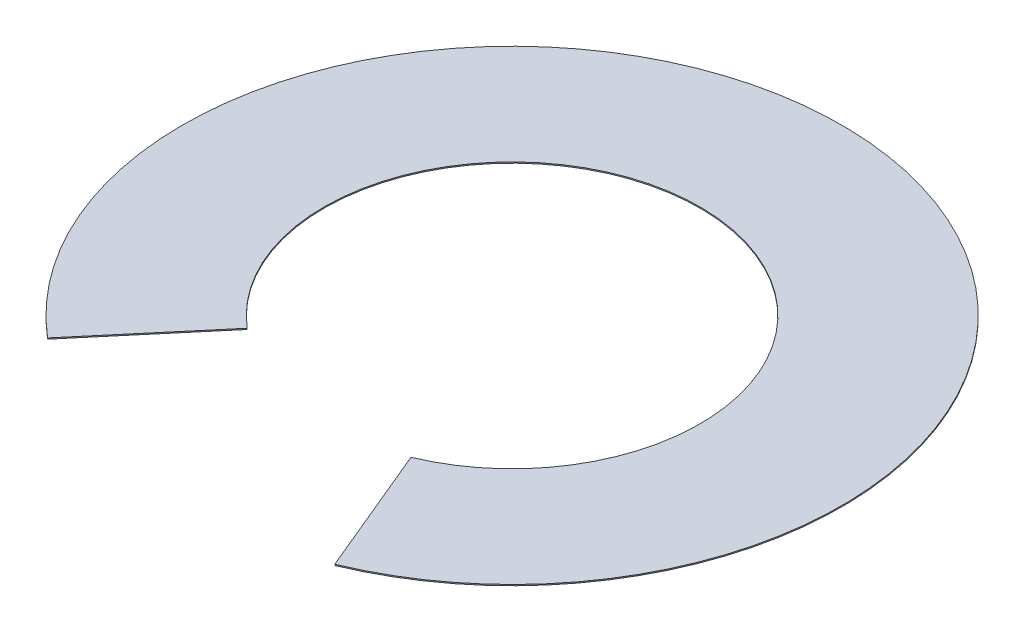
ISO-10303-21;
HEADER;
FILE_DESCRIPTION(('STEP AP214'),'2;1');
FILE_NAME('part.step','',(''),(''),'','','');
FILE_SCHEMA(('AUTOMOTIVE_DESIGN { 1 0 10303 214 1 1 1 1 }'));
ENDSEC;
DATA;
#1=APPLICATION_CONTEXT('core data for automotive mechanical design processes');
#2=APPLICATION_PROTOCOL_DEFINITION('international standard','automotive_design',2000,#1);
#3=PRODUCT_CONTEXT('',#1,'mechanical');
#4=PRODUCT('Part','Part','',(#3));
#5=PRODUCT_RELATED_PRODUCT_CATEGORY('part','',(#4));
#6=PRODUCT_DEFINITION_FORMATION('','',#4);
#7=PRODUCT_DEFINITION_CONTEXT('part definition',#1,'design');
#8=PRODUCT_DEFINITION('design','',#6,#7);
#9=PRODUCT_DEFINITION_SHAPE('','',#8);
#10=(LENGTH_UNIT() NAMED_UNIT(*) SI_UNIT(.MILLI.,.METRE.));
#11=(NAMED_UNIT(*) PLANE_ANGLE_UNIT() SI_UNIT($,.RADIAN.));
#12=(NAMED_UNIT(*) SI_UNIT($,.STERADIAN.) SOLID_ANGLE_UNIT());
#13=UNCERTAINTY_MEASURE_WITH_UNIT(LENGTH_MEASURE(1.E-05),#10,'distance_accuracy_value','');
#14=(GEOMETRIC_REPRESENTATION_CONTEXT(3) GLOBAL_UNCERTAINTY_ASSIGNED_CONTEXT((#13)) GLOBAL_UNIT_ASSIGNED_CONTEXT((#10,
#11,#12)) REPRESENTATION_CONTEXT('',''));
#15=CARTESIAN_POINT('',(0.,0.,0.));
#16=DIRECTION('',(0.,0.,1.));
#17=DIRECTION('',(1.,0.,0.));
#18=AXIS2_PLACEMENT_3D('',#15,#16,#17);
#19=CARTESIAN_POINT('',(0.,1.6,0.));
#20=DIRECTION('',(0.,-1.,0.));
#21=DIRECTION('',(0.,0.,-1.));
#22=AXIS2_PLACEMENT_3D('',#19,#20,#21);
#23=CYLINDRICAL_SURFACE('',#22,268.);
#24=CARTESIAN_POINT('',(0.,0.,0.));
#25=DIRECTION('',(0.,-1.,0.));
#26=DIRECTION('',(0.,0.,1.));
#27=AXIS2_PLACEMENT_3D('',#24,#25,#26);
#28=CIRCLE('',#27,268.);
#29=CARTESIAN_POINT('',(-172.957520303554,0.,204.718577980714));
#30=VERTEX_POINT('',#29);
#31=CARTESIAN_POINT('',(103.176288503488,0.,247.343189699342));
#32=VERTEX_POINT('',#31);
#33=EDGE_CURVE('E94',#30,#32,#28,.T.);
#34=ORIENTED_EDGE('',*,*,#33,.T.);
#35=DIRECTION('',(0.,-1.,0.));
#36=VECTOR('',#35,1.);
#37=CARTESIAN_POINT('',(103.176288503488,1.6,247.343189699342));
#38=LINE('',#37,#36);
#39=CARTESIAN_POINT('',(103.176288503488,1.6,247.343189699342));
#40=VERTEX_POINT('',#39);
#41=EDGE_CURVE('E11',#40,#32,#38,.T.);
#42=ORIENTED_EDGE('',*,*,#41,.F.);
#43=CARTESIAN_POINT('',(0.,1.6,0.));
#44=DIRECTION('',(0.,-1.,0.));
#45=DIRECTION('',(0.,0.,1.));
#46=AXIS2_PLACEMENT_3D('',#43,#44,#45);
#47=CIRCLE('',#46,268.);
#48=CARTESIAN_POINT('',(-172.957520303554,1.6,204.718577980714));
#49=VERTEX_POINT('',#48);
#50=EDGE_CURVE('E82',#49,#40,#47,.T.);
#51=ORIENTED_EDGE('',*,*,#50,.F.);
#52=DIRECTION('',(0.,-1.,0.));
#53=VECTOR('',#52,1.);
#54=CARTESIAN_POINT('',(-172.957520303554,1.6,204.718577980714));
#55=LINE('',#54,#53);
#56=EDGE_CURVE('E90',#49,#30,#55,.T.);
#57=ORIENTED_EDGE('',*,*,#56,.T.);
#58=EDGE_LOOP('',(#34,#42,#51,#57));
#59=FACE_BOUND('',#58,.T.);
#60=ADVANCED_FACE('F31',(#59),#23,.F.);
#61=CARTESIAN_POINT('',(103.176288503488,1.6,247.343189699342));
#62=DIRECTION('',(0.922922349624412,0.,-0.384986151132421));
#63=DIRECTION('',(-0.384986151132421,0.,-0.922922349624412));
#64=AXIS2_PLACEMENT_3D('',#61,#62,#63);
#65=PLANE('',#64);
#66=DIRECTION('',(0.384986151132421,0.,0.922922349624412));
#67=VECTOR('',#66,1.);
#68=CARTESIAN_POINT('',(103.176288503488,0.,247.343189699342));
#69=LINE('',#68,#67);
#70=CARTESIAN_POINT('',(180.943491032237,0.,433.773504323474));
#71=VERTEX_POINT('',#70);
#72=EDGE_CURVE('E86',#32,#71,#69,.T.);
#73=ORIENTED_EDGE('',*,*,#72,.T.);
#74=DIRECTION('',(0.,-1.,0.));
#75=VECTOR('',#74,1.);
#76=CARTESIAN_POINT('',(180.943491032237,1.6,433.773504323474));
#77=LINE('',#76,#75);
#78=CARTESIAN_POINT('',(180.943491032237,1.6,433.773504323474));
#79=VERTEX_POINT('',#78);
#80=EDGE_CURVE('E39',#79,#71,#77,.T.);
#81=ORIENTED_EDGE('',*,*,#80,.F.);
#82=DIRECTION('',(0.384986151132421,0.,0.922922349624412));
#83=VECTOR('',#82,1.);
#84=CARTESIAN_POINT('',(103.176288503488,1.6,247.343189699342));
#85=LINE('',#84,#83);
#86=EDGE_CURVE('E77',#40,#79,#85,.T.);
#87=ORIENTED_EDGE('',*,*,#86,.F.);
#88=ORIENTED_EDGE('',*,*,#41,.T.);
#89=EDGE_LOOP('',(#73,#81,#87,#88));
#90=FACE_BOUND('',#89,.T.);
#91=ADVANCED_FACE('F85',(#90),#65,.F.);
#92=CARTESIAN_POINT('',(0.,1.6,0.));
#93=DIRECTION('',(0.,-1.,0.));
#94=DIRECTION('',(0.,0.,-1.));
#95=AXIS2_PLACEMENT_3D('',#92,#93,#94);
#96=CYLINDRICAL_SURFACE('',#95,470.);
#97=CARTESIAN_POINT('',(0.,0.,0.));
#98=DIRECTION('',(0.,1.,0.));
#99=DIRECTION('',(0.,0.,1.));
#100=AXIS2_PLACEMENT_3D('',#97,#98,#99);
#101=CIRCLE('',#100,470.);
#102=CARTESIAN_POINT('',(-303.321024412949,0.,359.021386757222));
#103=VERTEX_POINT('',#102);
#104=EDGE_CURVE('E64',#71,#103,#101,.T.);
#105=ORIENTED_EDGE('',*,*,#104,.T.);
#106=DIRECTION('',(0.,-1.,0.));
#107=VECTOR('',#106,1.);
#108=CARTESIAN_POINT('',(-303.321024412949,1.6,359.021386757222));
#109=LINE('',#108,#107);
#110=CARTESIAN_POINT('',(-303.321024412949,1.6,359.021386757222));
#111=VERTEX_POINT('',#110);
#112=EDGE_CURVE('E87',#111,#103,#109,.T.);
#113=ORIENTED_EDGE('',*,*,#112,.F.);
#114=CARTESIAN_POINT('',(0.,1.6,0.));
#115=DIRECTION('',(0.,1.,0.));
#116=DIRECTION('',(0.,0.,1.));
#117=AXIS2_PLACEMENT_3D('',#114,#115,#116);
#118=CIRCLE('',#117,470.);
#119=EDGE_CURVE('E80',#79,#111,#118,.T.);
#120=ORIENTED_EDGE('',*,*,#119,.F.);
#121=ORIENTED_EDGE('',*,*,#80,.T.);
#122=EDGE_LOOP('',(#105,#113,#120,#121));
#123=FACE_BOUND('',#122,.T.);
#124=ADVANCED_FACE('F88',(#123),#96,.T.);
#125=CARTESIAN_POINT('',(-172.957520303554,1.6,204.718577980714));
#126=DIRECTION('',(-0.763875290972814,0.,-0.645363881729678));
#127=DIRECTION('',(-0.645363881729678,0.,0.763875290972814));
#128=AXIS2_PLACEMENT_3D('',#125,#126,#127);
#129=PLANE('',#128);
#130=DIRECTION('',(0.645363881729678,0.,-0.763875290972814));
#131=VECTOR('',#130,1.);
#132=CARTESIAN_POINT('',(-172.957520303554,0.,204.718577980714));
#133=LINE('',#132,#131);
#134=EDGE_CURVE('E70',#103,#30,#133,.T.);
#135=ORIENTED_EDGE('',*,*,#134,.T.);
#136=ORIENTED_EDGE('',*,*,#56,.F.);
#137=DIRECTION('',(0.645363881729678,0.,-0.763875290972814));
#138=VECTOR('',#137,1.);
#139=CARTESIAN_POINT('',(-172.957520303554,1.6,204.718577980714));
#140=LINE('',#139,#138);
#141=EDGE_CURVE('E47',#111,#49,#140,.T.);
#142=ORIENTED_EDGE('',*,*,#141,.F.);
#143=ORIENTED_EDGE('',*,*,#112,.T.);
#144=EDGE_LOOP('',(#135,#136,#142,#143));
#145=FACE_BOUND('',#144,.T.);
#146=ADVANCED_FACE('F101',(#145),#129,.F.);
#147=CARTESIAN_POINT('',(0.,1.6,0.));
#148=DIRECTION('',(0.,1.,0.));
#149=DIRECTION('',(0.,0.,1.));
#150=AXIS2_PLACEMENT_3D('',#147,#148,#149);
#151=PLANE('',#150);
#152=ORIENTED_EDGE('',*,*,#50,.T.);
#153=ORIENTED_EDGE('',*,*,#86,.T.);
#154=ORIENTED_EDGE('',*,*,#119,.T.);
#155=ORIENTED_EDGE('',*,*,#141,.T.);
#156=EDGE_LOOP('',(#152,#153,#154,#155));
#157=FACE_BOUND('',#156,.T.);
#158=ADVANCED_FACE('F78',(#157),#151,.T.);
#159=CARTESIAN_POINT('',(0.,0.,0.));
#160=DIRECTION('',(0.,1.,0.));
#161=DIRECTION('',(0.,0.,1.));
#162=AXIS2_PLACEMENT_3D('',#159,#160,#161);
#163=PLANE('',#162);
#164=ORIENTED_EDGE('',*,*,#33,.F.);
#165=ORIENTED_EDGE('',*,*,#134,.F.);
#166=ORIENTED_EDGE('',*,*,#104,.F.);
#167=ORIENTED_EDGE('',*,*,#72,.F.);
#168=EDGE_LOOP('',(#164,#165,#166,#167));
#169=FACE_BOUND('',#168,.T.);
#170=ADVANCED_FACE('F104',(#169),#163,.F.);
#171=CLOSED_SHELL('',(#60,#91,#124,#146,#158,#170));
#172=MANIFOLD_SOLID_BREP('B2',#171);
#173=ADVANCED_BREP_SHAPE_REPRESENTATION('',(#18,#172),#14);
#174=SHAPE_DEFINITION_REPRESENTATION(#9,#173);
ENDSEC;
END-ISO-10303-21;
